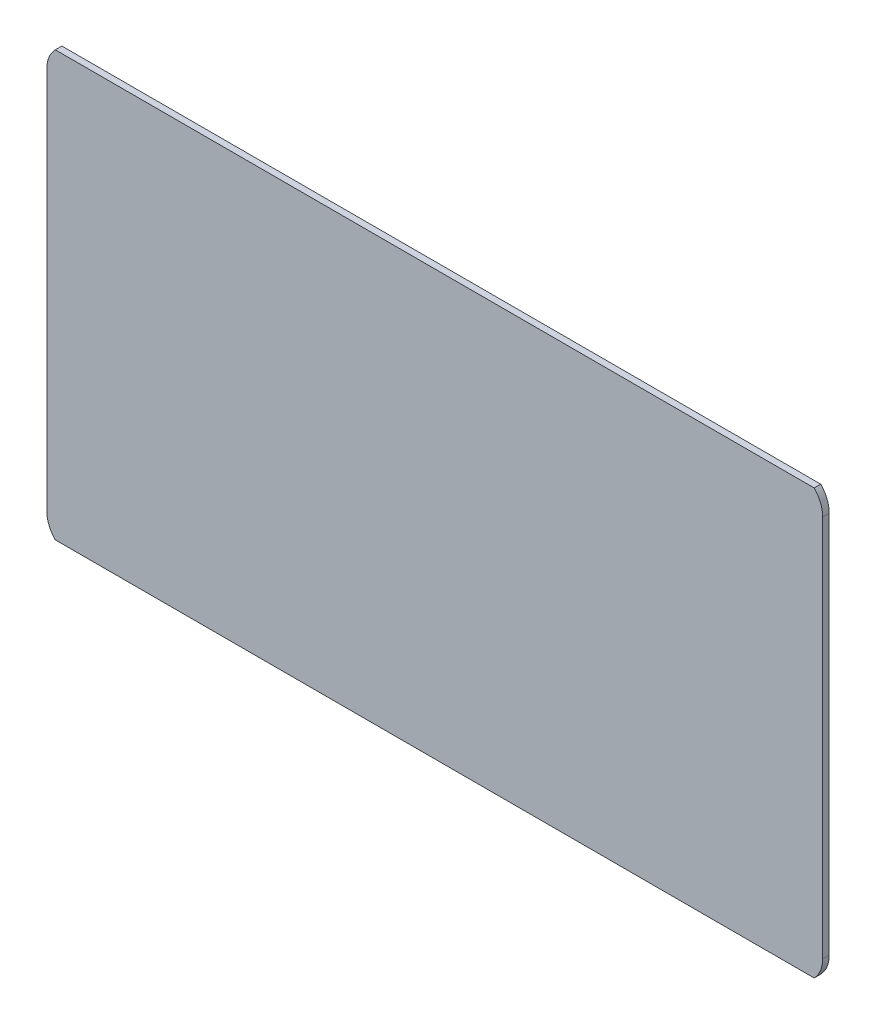
ISO-10303-21;
HEADER;
FILE_DESCRIPTION(('STEP AP214'),'2;1');
FILE_NAME('part.step','',(''),(''),'','','');
FILE_SCHEMA(('AUTOMOTIVE_DESIGN { 1 0 10303 214 1 1 1 1 }'));
ENDSEC;
DATA;
#1=APPLICATION_CONTEXT('core data for automotive mechanical design processes');
#2=APPLICATION_PROTOCOL_DEFINITION('international standard','automotive_design',2000,#1);
#3=PRODUCT_CONTEXT('',#1,'mechanical');
#4=PRODUCT('Part','Part','',(#3));
#5=PRODUCT_RELATED_PRODUCT_CATEGORY('part','',(#4));
#6=PRODUCT_DEFINITION_FORMATION('','',#4);
#7=PRODUCT_DEFINITION_CONTEXT('part definition',#1,'design');
#8=PRODUCT_DEFINITION('design','',#6,#7);
#9=PRODUCT_DEFINITION_SHAPE('','',#8);
#10=(LENGTH_UNIT() NAMED_UNIT(*) SI_UNIT(.MILLI.,.METRE.));
#11=(NAMED_UNIT(*) PLANE_ANGLE_UNIT() SI_UNIT($,.RADIAN.));
#12=(NAMED_UNIT(*) SI_UNIT($,.STERADIAN.) SOLID_ANGLE_UNIT());
#13=UNCERTAINTY_MEASURE_WITH_UNIT(LENGTH_MEASURE(1.E-05),#10,'distance_accuracy_value','');
#14=(GEOMETRIC_REPRESENTATION_CONTEXT(3) GLOBAL_UNCERTAINTY_ASSIGNED_CONTEXT((#13)) GLOBAL_UNIT_ASSIGNED_CONTEXT((#10,
#11,#12)) REPRESENTATION_CONTEXT('',''));
#15=CARTESIAN_POINT('',(0.,0.,0.));
#16=DIRECTION('',(0.,0.,1.));
#17=DIRECTION('',(1.,0.,0.));
#18=AXIS2_PLACEMENT_3D('',#15,#16,#17);
#19=CARTESIAN_POINT('',(0.,0.,1.1));
#20=DIRECTION('',(1.,0.,0.));
#21=DIRECTION('',(0.,1.,0.));
#22=AXIS2_PLACEMENT_3D('',#19,#20,#21);
#23=PLANE('',#22);
#24=DIRECTION('',(0.,-1.,0.));
#25=VECTOR('',#24,1.);
#26=CARTESIAN_POINT('',(0.,0.,0.));
#27=LINE('',#26,#25);
#28=CARTESIAN_POINT('',(0.,-3.50000000000003,0.));
#29=VERTEX_POINT('',#28);
#30=CARTESIAN_POINT('',(0.,-67.7399999999999,0.));
#31=VERTEX_POINT('',#30);
#32=EDGE_CURVE('E130',#29,#31,#27,.T.);
#33=ORIENTED_EDGE('',*,*,#32,.T.);
#34=DIRECTION('',(0.,0.,1.));
#35=VECTOR('',#34,1.);
#36=CARTESIAN_POINT('',(0.,-67.74,-0.3));
#37=LINE('',#36,#35);
#38=CARTESIAN_POINT('',(0.,-67.74,1.1));
#39=VERTEX_POINT('',#38);
#40=EDGE_CURVE('E149',#31,#39,#37,.T.);
#41=ORIENTED_EDGE('',*,*,#40,.T.);
#42=DIRECTION('',(0.,-1.,0.));
#43=VECTOR('',#42,1.);
#44=CARTESIAN_POINT('',(0.,0.,1.1));
#45=LINE('',#44,#43);
#46=CARTESIAN_POINT('',(0.,-3.50000000000003,1.1));
#47=VERTEX_POINT('',#46);
#48=EDGE_CURVE('E126',#47,#39,#45,.T.);
#49=ORIENTED_EDGE('',*,*,#48,.F.);
#50=DIRECTION('',(0.,0.,1.));
#51=VECTOR('',#50,1.);
#52=CARTESIAN_POINT('',(0.,-3.50000000000003,-0.3));
#53=LINE('',#52,#51);
#54=EDGE_CURVE('E115',#29,#47,#53,.T.);
#55=ORIENTED_EDGE('',*,*,#54,.F.);
#56=EDGE_LOOP('',(#33,#41,#49,#55));
#57=FACE_BOUND('',#56,.T.);
#58=ADVANCED_FACE('F35',(#57),#23,.F.);
#59=CARTESIAN_POINT('',(0.,-71.24,1.1));
#60=DIRECTION('',(0.,1.,0.));
#61=DIRECTION('',(0.,0.,1.));
#62=AXIS2_PLACEMENT_3D('',#59,#60,#61);
#63=PLANE('',#62);
#64=DIRECTION('',(0.,0.,1.));
#65=VECTOR('',#64,1.);
#66=CARTESIAN_POINT('',(128.810714214271,-71.24,-0.3));
#67=LINE('',#66,#65);
#68=CARTESIAN_POINT('',(128.810714214271,-71.24,1.1));
#69=VERTEX_POINT('',#68);
#70=CARTESIAN_POINT('',(128.810714214271,-71.24,0.));
#71=VERTEX_POINT('',#70);
#72=EDGE_CURVE('E48',#69,#71,#67,.F.);
#73=ORIENTED_EDGE('',*,*,#72,.F.);
#74=DIRECTION('',(1.,0.,0.));
#75=VECTOR('',#74,1.);
#76=CARTESIAN_POINT('',(0.,-71.24,1.1));
#77=LINE('',#76,#75);
#78=CARTESIAN_POINT('',(1.42928578572858,-71.24,1.1));
#79=VERTEX_POINT('',#78);
#80=EDGE_CURVE('E122',#79,#69,#77,.T.);
#81=ORIENTED_EDGE('',*,*,#80,.F.);
#82=DIRECTION('',(0.,0.,1.));
#83=VECTOR('',#82,1.);
#84=CARTESIAN_POINT('',(1.42928578572858,-71.24,-0.3));
#85=LINE('',#84,#83);
#86=CARTESIAN_POINT('',(1.42928578572858,-71.24,0.));
#87=VERTEX_POINT('',#86);
#88=EDGE_CURVE('E146',#87,#79,#85,.T.);
#89=ORIENTED_EDGE('',*,*,#88,.F.);
#90=DIRECTION('',(1.,0.,0.));
#91=VECTOR('',#90,1.);
#92=CARTESIAN_POINT('',(0.,-71.24,0.));
#93=LINE('',#92,#91);
#94=EDGE_CURVE('E133',#87,#71,#93,.T.);
#95=ORIENTED_EDGE('',*,*,#94,.T.);
#96=EDGE_LOOP('',(#73,#81,#89,#95));
#97=FACE_BOUND('',#96,.T.);
#98=ADVANCED_FACE('F155',(#97),#63,.F.);
#99=CARTESIAN_POINT('',(130.24,0.,1.1));
#100=DIRECTION('',(-1.,0.,0.));
#101=DIRECTION('',(0.,0.,1.));
#102=AXIS2_PLACEMENT_3D('',#99,#100,#101);
#103=PLANE('',#102);
#104=DIRECTION('',(0.,0.,1.));
#105=VECTOR('',#104,1.);
#106=CARTESIAN_POINT('',(130.24,-67.74,-0.3));
#107=LINE('',#106,#105);
#108=CARTESIAN_POINT('',(130.24,-67.74,0.));
#109=VERTEX_POINT('',#108);
#110=CARTESIAN_POINT('',(130.24,-67.74,1.1));
#111=VERTEX_POINT('',#110);
#112=EDGE_CURVE('E116',#109,#111,#107,.T.);
#113=ORIENTED_EDGE('',*,*,#112,.F.);
#114=DIRECTION('',(0.,1.,0.));
#115=VECTOR('',#114,1.);
#116=CARTESIAN_POINT('',(130.24,0.,0.));
#117=LINE('',#116,#115);
#118=CARTESIAN_POINT('',(130.24,-3.50000000000003,0.));
#119=VERTEX_POINT('',#118);
#120=EDGE_CURVE('E114',#109,#119,#117,.T.);
#121=ORIENTED_EDGE('',*,*,#120,.T.);
#122=DIRECTION('',(0.,0.,1.));
#123=VECTOR('',#122,1.);
#124=CARTESIAN_POINT('',(130.24,-3.50000000000003,-0.3));
#125=LINE('',#124,#123);
#126=CARTESIAN_POINT('',(130.24,-3.50000000000003,1.1));
#127=VERTEX_POINT('',#126);
#128=EDGE_CURVE('E56',#119,#127,#125,.T.);
#129=ORIENTED_EDGE('',*,*,#128,.T.);
#130=DIRECTION('',(0.,1.,0.));
#131=VECTOR('',#130,1.);
#132=CARTESIAN_POINT('',(130.24,0.,1.1));
#133=LINE('',#132,#131);
#134=EDGE_CURVE('E112',#111,#127,#133,.T.);
#135=ORIENTED_EDGE('',*,*,#134,.F.);
#136=EDGE_LOOP('',(#113,#121,#129,#135));
#137=FACE_BOUND('',#136,.T.);
#138=ADVANCED_FACE('F111',(#137),#103,.F.);
#139=CARTESIAN_POINT('',(0.,0.,1.1));
#140=DIRECTION('',(0.,-1.,0.));
#141=DIRECTION('',(0.,0.,-1.));
#142=AXIS2_PLACEMENT_3D('',#139,#140,#141);
#143=PLANE('',#142);
#144=DIRECTION('',(0.,0.,1.));
#145=VECTOR('',#144,1.);
#146=CARTESIAN_POINT('',(1.42928578572858,0.,-0.3));
#147=LINE('',#146,#145);
#148=CARTESIAN_POINT('',(1.42928578572858,0.,1.1));
#149=VERTEX_POINT('',#148);
#150=CARTESIAN_POINT('',(1.42928578572858,0.,0.));
#151=VERTEX_POINT('',#150);
#152=EDGE_CURVE('E156',#149,#151,#147,.F.);
#153=ORIENTED_EDGE('',*,*,#152,.F.);
#154=DIRECTION('',(-1.,0.,0.));
#155=VECTOR('',#154,1.);
#156=CARTESIAN_POINT('',(0.,0.,1.1));
#157=LINE('',#156,#155);
#158=CARTESIAN_POINT('',(128.810714214271,0.,1.1));
#159=VERTEX_POINT('',#158);
#160=EDGE_CURVE('E121',#159,#149,#157,.T.);
#161=ORIENTED_EDGE('',*,*,#160,.F.);
#162=DIRECTION('',(0.,0.,1.));
#163=VECTOR('',#162,1.);
#164=CARTESIAN_POINT('',(128.810714214271,0.,-0.3));
#165=LINE('',#164,#163);
#166=CARTESIAN_POINT('',(128.810714214271,0.,0.));
#167=VERTEX_POINT('',#166);
#168=EDGE_CURVE('E99',#167,#159,#165,.T.);
#169=ORIENTED_EDGE('',*,*,#168,.F.);
#170=DIRECTION('',(-1.,0.,0.));
#171=VECTOR('',#170,1.);
#172=CARTESIAN_POINT('',(0.,0.,0.));
#173=LINE('',#172,#171);
#174=EDGE_CURVE('E137',#167,#151,#173,.T.);
#175=ORIENTED_EDGE('',*,*,#174,.T.);
#176=EDGE_LOOP('',(#153,#161,#169,#175));
#177=FACE_BOUND('',#176,.T.);
#178=ADVANCED_FACE('F181',(#177),#143,.F.);
#179=CARTESIAN_POINT('',(0.,0.,1.1));
#180=DIRECTION('',(0.,0.,1.));
#181=DIRECTION('',(1.,0.,0.));
#182=AXIS2_PLACEMENT_3D('',#179,#180,#181);
#183=PLANE('',#182);
#184=ORIENTED_EDGE('',*,*,#80,.T.);
#185=CARTESIAN_POINT('',(125.24,-67.74,1.1));
#186=DIRECTION('',(0.,0.,1.));
#187=DIRECTION('',(1.,0.,0.));
#188=AXIS2_PLACEMENT_3D('',#185,#186,#187);
#189=CIRCLE('',#188,5.);
#190=EDGE_CURVE('E105',#69,#111,#189,.T.);
#191=ORIENTED_EDGE('',*,*,#190,.T.);
#192=ORIENTED_EDGE('',*,*,#134,.T.);
#193=CARTESIAN_POINT('',(125.24,-3.5,1.1));
#194=DIRECTION('',(0.,0.,1.));
#195=DIRECTION('',(-1.,0.,0.));
#196=AXIS2_PLACEMENT_3D('',#193,#194,#195);
#197=CIRCLE('',#196,5.);
#198=EDGE_CURVE('E96',#127,#159,#197,.T.);
#199=ORIENTED_EDGE('',*,*,#198,.T.);
#200=ORIENTED_EDGE('',*,*,#160,.T.);
#201=CARTESIAN_POINT('',(5.,-3.5,1.1));
#202=DIRECTION('',(0.,0.,1.));
#203=DIRECTION('',(1.,0.,0.));
#204=AXIS2_PLACEMENT_3D('',#201,#202,#203);
#205=CIRCLE('',#204,5.);
#206=EDGE_CURVE('E104',#149,#47,#205,.T.);
#207=ORIENTED_EDGE('',*,*,#206,.T.);
#208=ORIENTED_EDGE('',*,*,#48,.T.);
#209=CARTESIAN_POINT('',(5.00000000000001,-67.74,1.1));
#210=DIRECTION('',(0.,0.,1.));
#211=DIRECTION('',(1.,0.,0.));
#212=AXIS2_PLACEMENT_3D('',#209,#210,#211);
#213=CIRCLE('',#212,5.);
#214=EDGE_CURVE('E160',#39,#79,#213,.T.);
#215=ORIENTED_EDGE('',*,*,#214,.T.);
#216=EDGE_LOOP('',(#184,#191,#192,#199,#200,#207,#208,#215));
#217=FACE_BOUND('',#216,.T.);
#218=ADVANCED_FACE('F120',(#217),#183,.T.);
#219=CARTESIAN_POINT('',(0.,0.,0.));
#220=DIRECTION('',(0.,0.,1.));
#221=DIRECTION('',(1.,0.,0.));
#222=AXIS2_PLACEMENT_3D('',#219,#220,#221);
#223=PLANE('',#222);
#224=CARTESIAN_POINT('',(125.24,-67.74,0.));
#225=DIRECTION('',(0.,0.,1.));
#226=DIRECTION('',(1.,0.,0.));
#227=AXIS2_PLACEMENT_3D('',#224,#225,#226);
#228=CIRCLE('',#227,5.);
#229=EDGE_CURVE('E11',#71,#109,#228,.T.);
#230=ORIENTED_EDGE('',*,*,#229,.F.);
#231=ORIENTED_EDGE('',*,*,#94,.F.);
#232=CARTESIAN_POINT('',(5.00000000000001,-67.74,0.));
#233=DIRECTION('',(0.,0.,1.));
#234=DIRECTION('',(1.,0.,0.));
#235=AXIS2_PLACEMENT_3D('',#232,#233,#234);
#236=CIRCLE('',#235,5.);
#237=EDGE_CURVE('E42',#31,#87,#236,.T.);
#238=ORIENTED_EDGE('',*,*,#237,.F.);
#239=ORIENTED_EDGE('',*,*,#32,.F.);
#240=CARTESIAN_POINT('',(5.,-3.5,0.));
#241=DIRECTION('',(0.,0.,1.));
#242=DIRECTION('',(1.,0.,0.));
#243=AXIS2_PLACEMENT_3D('',#240,#241,#242);
#244=CIRCLE('',#243,5.);
#245=EDGE_CURVE('E141',#151,#29,#244,.T.);
#246=ORIENTED_EDGE('',*,*,#245,.F.);
#247=ORIENTED_EDGE('',*,*,#174,.F.);
#248=CARTESIAN_POINT('',(125.24,-3.5,0.));
#249=DIRECTION('',(0.,0.,1.));
#250=DIRECTION('',(1.,0.,0.));
#251=AXIS2_PLACEMENT_3D('',#248,#249,#250);
#252=CIRCLE('',#251,5.);
#253=EDGE_CURVE('E124',#119,#167,#252,.T.);
#254=ORIENTED_EDGE('',*,*,#253,.F.);
#255=ORIENTED_EDGE('',*,*,#120,.F.);
#256=EDGE_LOOP('',(#230,#231,#238,#239,#246,#247,#254,#255));
#257=FACE_BOUND('',#256,.T.);
#258=ADVANCED_FACE('F158',(#257),#223,.F.);
#259=CARTESIAN_POINT('',(125.24,-3.5,-0.3));
#260=DIRECTION('',(0.,0.,1.));
#261=DIRECTION('',(1.,0.,0.));
#262=AXIS2_PLACEMENT_3D('',#259,#260,#261);
#263=CYLINDRICAL_SURFACE('',#262,5.);
#264=ORIENTED_EDGE('',*,*,#168,.T.);
#265=ORIENTED_EDGE('',*,*,#198,.F.);
#266=ORIENTED_EDGE('',*,*,#128,.F.);
#267=ORIENTED_EDGE('',*,*,#253,.T.);
#268=EDGE_LOOP('',(#264,#265,#266,#267));
#269=FACE_BOUND('',#268,.T.);
#270=ADVANCED_FACE('F97',(#269),#263,.T.);
#271=CARTESIAN_POINT('',(5.,-3.5,-0.3));
#272=DIRECTION('',(0.,0.,1.));
#273=DIRECTION('',(1.,0.,0.));
#274=AXIS2_PLACEMENT_3D('',#271,#272,#273);
#275=CYLINDRICAL_SURFACE('',#274,5.);
#276=ORIENTED_EDGE('',*,*,#152,.T.);
#277=ORIENTED_EDGE('',*,*,#245,.T.);
#278=ORIENTED_EDGE('',*,*,#54,.T.);
#279=ORIENTED_EDGE('',*,*,#206,.F.);
#280=EDGE_LOOP('',(#276,#277,#278,#279));
#281=FACE_BOUND('',#280,.T.);
#282=ADVANCED_FACE('F176',(#281),#275,.T.);
#283=CARTESIAN_POINT('',(5.00000000000001,-67.74,-0.3));
#284=DIRECTION('',(0.,0.,1.));
#285=DIRECTION('',(1.,0.,0.));
#286=AXIS2_PLACEMENT_3D('',#283,#284,#285);
#287=CYLINDRICAL_SURFACE('',#286,5.);
#288=ORIENTED_EDGE('',*,*,#88,.T.);
#289=ORIENTED_EDGE('',*,*,#214,.F.);
#290=ORIENTED_EDGE('',*,*,#40,.F.);
#291=ORIENTED_EDGE('',*,*,#237,.T.);
#292=EDGE_LOOP('',(#288,#289,#290,#291));
#293=FACE_BOUND('',#292,.T.);
#294=ADVANCED_FACE('F145',(#293),#287,.T.);
#295=CARTESIAN_POINT('',(125.24,-67.74,-0.3));
#296=DIRECTION('',(0.,0.,1.));
#297=DIRECTION('',(1.,0.,0.));
#298=AXIS2_PLACEMENT_3D('',#295,#296,#297);
#299=CYLINDRICAL_SURFACE('',#298,5.);
#300=ORIENTED_EDGE('',*,*,#72,.T.);
#301=ORIENTED_EDGE('',*,*,#229,.T.);
#302=ORIENTED_EDGE('',*,*,#112,.T.);
#303=ORIENTED_EDGE('',*,*,#190,.F.);
#304=EDGE_LOOP('',(#300,#301,#302,#303));
#305=FACE_BOUND('',#304,.T.);
#306=ADVANCED_FACE('F159',(#305),#299,.T.);
#307=CLOSED_SHELL('',(#58,#98,#138,#178,#218,#258,#270,#282,#294,#306));
#308=MANIFOLD_SOLID_BREP('B2',#307);
#309=ADVANCED_BREP_SHAPE_REPRESENTATION('',(#18,#308),#14);
#310=SHAPE_DEFINITION_REPRESENTATION(#9,#309);
ENDSEC;
END-ISO-10303-21;
